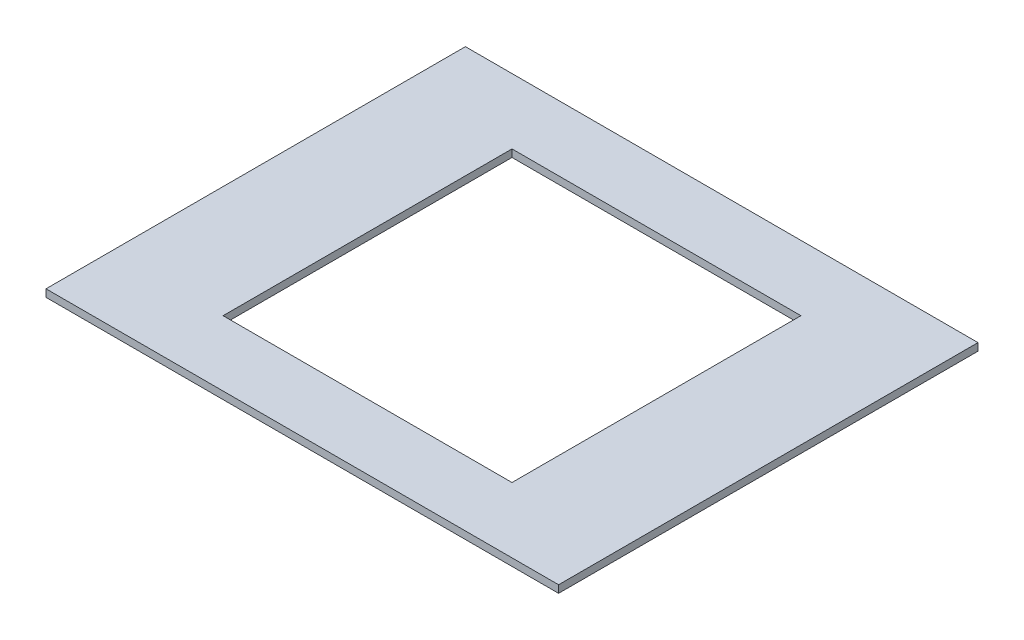
ISO-10303-21;
HEADER;
FILE_DESCRIPTION(('STEP AP214'),'2;1');
FILE_NAME('part.step','',(''),(''),'','','');
FILE_SCHEMA(('AUTOMOTIVE_DESIGN { 1 0 10303 214 1 1 1 1 }'));
ENDSEC;
DATA;
#1=APPLICATION_CONTEXT('core data for automotive mechanical design processes');
#2=APPLICATION_PROTOCOL_DEFINITION('international standard','automotive_design',2000,#1);
#3=PRODUCT_CONTEXT('',#1,'mechanical');
#4=PRODUCT('Part','Part','',(#3));
#5=PRODUCT_RELATED_PRODUCT_CATEGORY('part','',(#4));
#6=PRODUCT_DEFINITION_FORMATION('','',#4);
#7=PRODUCT_DEFINITION_CONTEXT('part definition',#1,'design');
#8=PRODUCT_DEFINITION('design','',#6,#7);
#9=PRODUCT_DEFINITION_SHAPE('','',#8);
#10=(LENGTH_UNIT() NAMED_UNIT(*) SI_UNIT(.MILLI.,.METRE.));
#11=(NAMED_UNIT(*) PLANE_ANGLE_UNIT() SI_UNIT($,.RADIAN.));
#12=(NAMED_UNIT(*) SI_UNIT($,.STERADIAN.) SOLID_ANGLE_UNIT());
#13=UNCERTAINTY_MEASURE_WITH_UNIT(LENGTH_MEASURE(1.E-05),#10,'distance_accuracy_value','');
#14=(GEOMETRIC_REPRESENTATION_CONTEXT(3) GLOBAL_UNCERTAINTY_ASSIGNED_CONTEXT((#13)) GLOBAL_UNIT_ASSIGNED_CONTEXT((#10,
#11,#12)) REPRESENTATION_CONTEXT('',''));
#15=CARTESIAN_POINT('',(0.,0.,0.));
#16=DIRECTION('',(0.,0.,1.));
#17=DIRECTION('',(1.,0.,0.));
#18=AXIS2_PLACEMENT_3D('',#15,#16,#17);
#19=CARTESIAN_POINT('',(0.,1.6,0.));
#20=DIRECTION('',(1.,0.,0.));
#21=DIRECTION('',(0.,0.,-1.));
#22=AXIS2_PLACEMENT_3D('',#19,#20,#21);
#23=PLANE('',#22);
#24=DIRECTION('',(0.,0.,1.));
#25=VECTOR('',#24,1.);
#26=CARTESIAN_POINT('',(0.,0.,0.));
#27=LINE('',#26,#25);
#28=CARTESIAN_POINT('',(0.,0.,-90.));
#29=VERTEX_POINT('',#28);
#30=CARTESIAN_POINT('',(0.,0.,0.));
#31=VERTEX_POINT('',#30);
#32=EDGE_CURVE('E132',#29,#31,#27,.T.);
#33=ORIENTED_EDGE('',*,*,#32,.T.);
#34=DIRECTION('',(0.,-1.,0.));
#35=VECTOR('',#34,1.);
#36=CARTESIAN_POINT('',(0.,1.6,0.));
#37=LINE('',#36,#35);
#38=CARTESIAN_POINT('',(0.,1.6,0.));
#39=VERTEX_POINT('',#38);
#40=EDGE_CURVE('E11',#39,#31,#37,.T.);
#41=ORIENTED_EDGE('',*,*,#40,.F.);
#42=DIRECTION('',(0.,0.,1.));
#43=VECTOR('',#42,1.);
#44=CARTESIAN_POINT('',(0.,1.6,0.));
#45=LINE('',#44,#43);
#46=CARTESIAN_POINT('',(0.,1.6,-90.));
#47=VERTEX_POINT('',#46);
#48=EDGE_CURVE('E136',#47,#39,#45,.T.);
#49=ORIENTED_EDGE('',*,*,#48,.F.);
#50=DIRECTION('',(0.,-1.,0.));
#51=VECTOR('',#50,1.);
#52=CARTESIAN_POINT('',(0.,1.6,-90.));
#53=LINE('',#52,#51);
#54=EDGE_CURVE('E146',#47,#29,#53,.T.);
#55=ORIENTED_EDGE('',*,*,#54,.T.);
#56=EDGE_LOOP('',(#33,#41,#49,#55));
#57=FACE_BOUND('',#56,.T.);
#58=ADVANCED_FACE('F35',(#57),#23,.F.);
#59=CARTESIAN_POINT('',(0.,1.6,0.));
#60=DIRECTION('',(0.,0.,-1.));
#61=DIRECTION('',(-1.,0.,0.));
#62=AXIS2_PLACEMENT_3D('',#59,#60,#61);
#63=PLANE('',#62);
#64=DIRECTION('',(1.,0.,0.));
#65=VECTOR('',#64,1.);
#66=CARTESIAN_POINT('',(0.,0.,0.));
#67=LINE('',#66,#65);
#68=CARTESIAN_POINT('',(110.,0.,0.));
#69=VERTEX_POINT('',#68);
#70=EDGE_CURVE('E149',#31,#69,#67,.T.);
#71=ORIENTED_EDGE('',*,*,#70,.T.);
#72=DIRECTION('',(0.,-1.,0.));
#73=VECTOR('',#72,1.);
#74=CARTESIAN_POINT('',(110.,1.6,0.));
#75=LINE('',#74,#73);
#76=CARTESIAN_POINT('',(110.,1.6,0.));
#77=VERTEX_POINT('',#76);
#78=EDGE_CURVE('E42',#77,#69,#75,.T.);
#79=ORIENTED_EDGE('',*,*,#78,.F.);
#80=DIRECTION('',(1.,0.,0.));
#81=VECTOR('',#80,1.);
#82=CARTESIAN_POINT('',(0.,1.6,0.));
#83=LINE('',#82,#81);
#84=EDGE_CURVE('E139',#39,#77,#83,.T.);
#85=ORIENTED_EDGE('',*,*,#84,.F.);
#86=ORIENTED_EDGE('',*,*,#40,.T.);
#87=EDGE_LOOP('',(#71,#79,#85,#86));
#88=FACE_BOUND('',#87,.T.);
#89=ADVANCED_FACE('F177',(#88),#63,.F.);
#90=CARTESIAN_POINT('',(110.,1.6,0.));
#91=DIRECTION('',(-1.,0.,0.));
#92=DIRECTION('',(0.,0.,1.));
#93=AXIS2_PLACEMENT_3D('',#90,#91,#92);
#94=PLANE('',#93);
#95=DIRECTION('',(0.,0.,-1.));
#96=VECTOR('',#95,1.);
#97=CARTESIAN_POINT('',(110.,0.,0.));
#98=LINE('',#97,#96);
#99=CARTESIAN_POINT('',(110.,0.,-90.));
#100=VERTEX_POINT('',#99);
#101=EDGE_CURVE('E151',#69,#100,#98,.T.);
#102=ORIENTED_EDGE('',*,*,#101,.T.);
#103=DIRECTION('',(0.,-1.,0.));
#104=VECTOR('',#103,1.);
#105=CARTESIAN_POINT('',(110.,1.6,-90.));
#106=LINE('',#105,#104);
#107=CARTESIAN_POINT('',(110.,1.6,-90.));
#108=VERTEX_POINT('',#107);
#109=EDGE_CURVE('E156',#108,#100,#106,.T.);
#110=ORIENTED_EDGE('',*,*,#109,.F.);
#111=DIRECTION('',(0.,0.,-1.));
#112=VECTOR('',#111,1.);
#113=CARTESIAN_POINT('',(110.,1.6,0.));
#114=LINE('',#113,#112);
#115=EDGE_CURVE('E142',#77,#108,#114,.T.);
#116=ORIENTED_EDGE('',*,*,#115,.F.);
#117=ORIENTED_EDGE('',*,*,#78,.T.);
#118=EDGE_LOOP('',(#102,#110,#116,#117));
#119=FACE_BOUND('',#118,.T.);
#120=ADVANCED_FACE('F163',(#119),#94,.F.);
#121=CARTESIAN_POINT('',(0.,1.6,-90.));
#122=DIRECTION('',(0.,0.,1.));
#123=DIRECTION('',(1.,0.,0.));
#124=AXIS2_PLACEMENT_3D('',#121,#122,#123);
#125=PLANE('',#124);
#126=DIRECTION('',(-1.,0.,0.));
#127=VECTOR('',#126,1.);
#128=CARTESIAN_POINT('',(0.,0.,-90.));
#129=LINE('',#128,#127);
#130=EDGE_CURVE('E140',#100,#29,#129,.T.);
#131=ORIENTED_EDGE('',*,*,#130,.T.);
#132=ORIENTED_EDGE('',*,*,#54,.F.);
#133=DIRECTION('',(-1.,0.,0.));
#134=VECTOR('',#133,1.);
#135=CARTESIAN_POINT('',(0.,1.6,-90.));
#136=LINE('',#135,#134);
#137=EDGE_CURVE('E144',#108,#47,#136,.T.);
#138=ORIENTED_EDGE('',*,*,#137,.F.);
#139=ORIENTED_EDGE('',*,*,#109,.T.);
#140=EDGE_LOOP('',(#131,#132,#138,#139));
#141=FACE_BOUND('',#140,.T.);
#142=ADVANCED_FACE('F170',(#141),#125,.F.);
#143=CARTESIAN_POINT('',(0.,1.6,0.));
#144=DIRECTION('',(0.,-1.,0.));
#145=DIRECTION('',(0.,0.,-1.));
#146=AXIS2_PLACEMENT_3D('',#143,#144,#145);
#147=PLANE('',#146);
#148=DIRECTION('',(-1.,0.,0.));
#149=VECTOR('',#148,1.);
#150=CARTESIAN_POINT('',(55.,1.6,-76.));
#151=LINE('',#150,#149);
#152=CARTESIAN_POINT('',(86.,1.6,-76.));
#153=VERTEX_POINT('',#152);
#154=CARTESIAN_POINT('',(24.,1.6,-76.));
#155=VERTEX_POINT('',#154);
#156=EDGE_CURVE('E123',#153,#155,#151,.T.);
#157=ORIENTED_EDGE('',*,*,#156,.F.);
#158=DIRECTION('',(0.,0.,-1.));
#159=VECTOR('',#158,1.);
#160=CARTESIAN_POINT('',(86.,1.6,-45.));
#161=LINE('',#160,#159);
#162=CARTESIAN_POINT('',(86.,1.6,-14.));
#163=VERTEX_POINT('',#162);
#164=EDGE_CURVE('E103',#163,#153,#161,.T.);
#165=ORIENTED_EDGE('',*,*,#164,.F.);
#166=DIRECTION('',(1.,0.,0.));
#167=VECTOR('',#166,1.);
#168=CARTESIAN_POINT('',(55.,1.6,-14.));
#169=LINE('',#168,#167);
#170=CARTESIAN_POINT('',(24.,1.6,-14.));
#171=VERTEX_POINT('',#170);
#172=EDGE_CURVE('E118',#171,#163,#169,.T.);
#173=ORIENTED_EDGE('',*,*,#172,.F.);
#174=DIRECTION('',(0.,0.,1.));
#175=VECTOR('',#174,1.);
#176=CARTESIAN_POINT('',(24.,1.6,-45.));
#177=LINE('',#176,#175);
#178=EDGE_CURVE('E125',#155,#171,#177,.T.);
#179=ORIENTED_EDGE('',*,*,#178,.F.);
#180=EDGE_LOOP('',(#157,#165,#173,#179));
#181=FACE_BOUND('',#180,.T.);
#182=ORIENTED_EDGE('',*,*,#48,.T.);
#183=ORIENTED_EDGE('',*,*,#84,.T.);
#184=ORIENTED_EDGE('',*,*,#115,.T.);
#185=ORIENTED_EDGE('',*,*,#137,.T.);
#186=EDGE_LOOP('',(#182,#183,#184,#185));
#187=FACE_BOUND('',#186,.T.);
#188=ADVANCED_FACE('F176',(#181,#187),#147,.F.);
#189=CARTESIAN_POINT('',(0.,0.,0.));
#190=DIRECTION('',(0.,-1.,0.));
#191=DIRECTION('',(0.,0.,-1.));
#192=AXIS2_PLACEMENT_3D('',#189,#190,#191);
#193=PLANE('',#192);
#194=DIRECTION('',(0.,0.,-1.));
#195=VECTOR('',#194,1.);
#196=CARTESIAN_POINT('',(86.,0.,-45.));
#197=LINE('',#196,#195);
#198=CARTESIAN_POINT('',(86.,0.,-14.));
#199=VERTEX_POINT('',#198);
#200=CARTESIAN_POINT('',(86.,0.,-76.));
#201=VERTEX_POINT('',#200);
#202=EDGE_CURVE('E100',#199,#201,#197,.T.);
#203=ORIENTED_EDGE('',*,*,#202,.T.);
#204=DIRECTION('',(-1.,0.,0.));
#205=VECTOR('',#204,1.);
#206=CARTESIAN_POINT('',(55.,0.,-76.));
#207=LINE('',#206,#205);
#208=CARTESIAN_POINT('',(24.,0.,-76.));
#209=VERTEX_POINT('',#208);
#210=EDGE_CURVE('E109',#201,#209,#207,.T.);
#211=ORIENTED_EDGE('',*,*,#210,.T.);
#212=DIRECTION('',(0.,0.,1.));
#213=VECTOR('',#212,1.);
#214=CARTESIAN_POINT('',(24.,0.,-45.));
#215=LINE('',#214,#213);
#216=CARTESIAN_POINT('',(24.,0.,-14.));
#217=VERTEX_POINT('',#216);
#218=EDGE_CURVE('E57',#209,#217,#215,.T.);
#219=ORIENTED_EDGE('',*,*,#218,.T.);
#220=DIRECTION('',(1.,0.,0.));
#221=VECTOR('',#220,1.);
#222=CARTESIAN_POINT('',(55.,0.,-14.));
#223=LINE('',#222,#221);
#224=EDGE_CURVE('E106',#217,#199,#223,.T.);
#225=ORIENTED_EDGE('',*,*,#224,.T.);
#226=EDGE_LOOP('',(#203,#211,#219,#225));
#227=FACE_BOUND('',#226,.T.);
#228=ORIENTED_EDGE('',*,*,#32,.F.);
#229=ORIENTED_EDGE('',*,*,#130,.F.);
#230=ORIENTED_EDGE('',*,*,#101,.F.);
#231=ORIENTED_EDGE('',*,*,#70,.F.);
#232=EDGE_LOOP('',(#228,#229,#230,#231));
#233=FACE_BOUND('',#232,.T.);
#234=ADVANCED_FACE('F114',(#227,#233),#193,.T.);
#235=CARTESIAN_POINT('',(86.,0.,-45.));
#236=DIRECTION('',(1.,0.,0.));
#237=DIRECTION('',(0.,0.,-1.));
#238=AXIS2_PLACEMENT_3D('',#235,#236,#237);
#239=PLANE('',#238);
#240=ORIENTED_EDGE('',*,*,#164,.T.);
#241=DIRECTION('',(0.,1.,0.));
#242=VECTOR('',#241,1.);
#243=CARTESIAN_POINT('',(86.,0.,-76.));
#244=LINE('',#243,#242);
#245=EDGE_CURVE('E49',#201,#153,#244,.T.);
#246=ORIENTED_EDGE('',*,*,#245,.F.);
#247=ORIENTED_EDGE('',*,*,#202,.F.);
#248=DIRECTION('',(0.,1.,0.));
#249=VECTOR('',#248,1.);
#250=CARTESIAN_POINT('',(86.,0.,-14.));
#251=LINE('',#250,#249);
#252=EDGE_CURVE('E130',#199,#163,#251,.T.);
#253=ORIENTED_EDGE('',*,*,#252,.T.);
#254=EDGE_LOOP('',(#240,#246,#247,#253));
#255=FACE_BOUND('',#254,.T.);
#256=ADVANCED_FACE('F98',(#255),#239,.F.);
#257=CARTESIAN_POINT('',(55.,0.,-14.));
#258=DIRECTION('',(0.,0.,1.));
#259=DIRECTION('',(1.,0.,0.));
#260=AXIS2_PLACEMENT_3D('',#257,#258,#259);
#261=PLANE('',#260);
#262=ORIENTED_EDGE('',*,*,#172,.T.);
#263=ORIENTED_EDGE('',*,*,#252,.F.);
#264=ORIENTED_EDGE('',*,*,#224,.F.);
#265=DIRECTION('',(0.,1.,0.));
#266=VECTOR('',#265,1.);
#267=CARTESIAN_POINT('',(24.,0.,-14.));
#268=LINE('',#267,#266);
#269=EDGE_CURVE('E133',#217,#171,#268,.T.);
#270=ORIENTED_EDGE('',*,*,#269,.T.);
#271=EDGE_LOOP('',(#262,#263,#264,#270));
#272=FACE_BOUND('',#271,.T.);
#273=ADVANCED_FACE('F197',(#272),#261,.F.);
#274=CARTESIAN_POINT('',(24.,0.,-45.));
#275=DIRECTION('',(-1.,0.,0.));
#276=DIRECTION('',(0.,0.,1.));
#277=AXIS2_PLACEMENT_3D('',#274,#275,#276);
#278=PLANE('',#277);
#279=ORIENTED_EDGE('',*,*,#178,.T.);
#280=ORIENTED_EDGE('',*,*,#269,.F.);
#281=ORIENTED_EDGE('',*,*,#218,.F.);
#282=DIRECTION('',(0.,1.,0.));
#283=VECTOR('',#282,1.);
#284=CARTESIAN_POINT('',(24.,0.,-76.));
#285=LINE('',#284,#283);
#286=EDGE_CURVE('E105',#209,#155,#285,.T.);
#287=ORIENTED_EDGE('',*,*,#286,.T.);
#288=EDGE_LOOP('',(#279,#280,#281,#287));
#289=FACE_BOUND('',#288,.T.);
#290=ADVANCED_FACE('F194',(#289),#278,.F.);
#291=CARTESIAN_POINT('',(55.,0.,-76.));
#292=DIRECTION('',(0.,0.,-1.));
#293=DIRECTION('',(-1.,0.,0.));
#294=AXIS2_PLACEMENT_3D('',#291,#292,#293);
#295=PLANE('',#294);
#296=ORIENTED_EDGE('',*,*,#156,.T.);
#297=ORIENTED_EDGE('',*,*,#286,.F.);
#298=ORIENTED_EDGE('',*,*,#210,.F.);
#299=ORIENTED_EDGE('',*,*,#245,.T.);
#300=EDGE_LOOP('',(#296,#297,#298,#299));
#301=FACE_BOUND('',#300,.T.);
#302=ADVANCED_FACE('F110',(#301),#295,.F.);
#303=CLOSED_SHELL('',(#58,#89,#120,#142,#188,#234,#256,#273,#290,#302));
#304=MANIFOLD_SOLID_BREP('B2',#303);
#305=ADVANCED_BREP_SHAPE_REPRESENTATION('',(#18,#304),#14);
#306=SHAPE_DEFINITION_REPRESENTATION(#9,#305);
ENDSEC;
END-ISO-10303-21;
